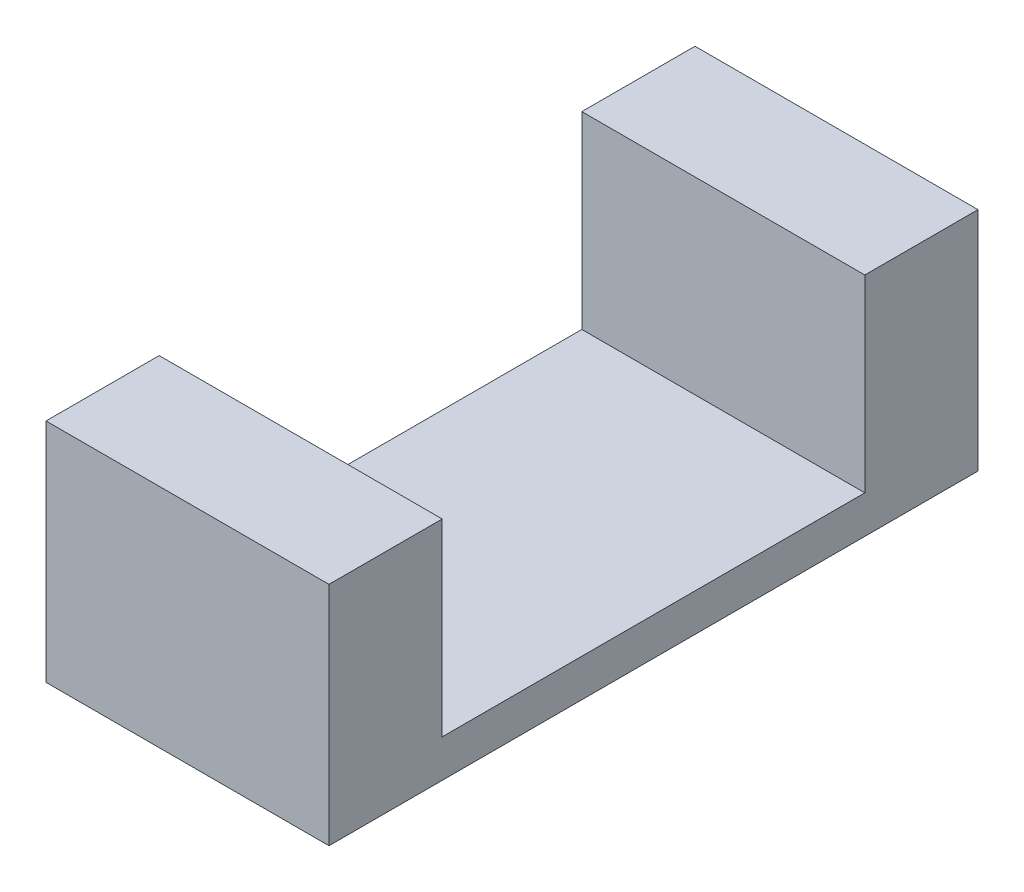
ISO-10303-21;
HEADER;
FILE_DESCRIPTION(('STEP AP214'),'2;1');
FILE_NAME('part.step','',(''),(''),'','','');
FILE_SCHEMA(('AUTOMOTIVE_DESIGN { 1 0 10303 214 1 1 1 1 }'));
ENDSEC;
DATA;
#1=APPLICATION_CONTEXT('core data for automotive mechanical design processes');
#2=APPLICATION_PROTOCOL_DEFINITION('international standard','automotive_design',2000,#1);
#3=PRODUCT_CONTEXT('',#1,'mechanical');
#4=PRODUCT('Part','Part','',(#3));
#5=PRODUCT_RELATED_PRODUCT_CATEGORY('part','',(#4));
#6=PRODUCT_DEFINITION_FORMATION('','',#4);
#7=PRODUCT_DEFINITION_CONTEXT('part definition',#1,'design');
#8=PRODUCT_DEFINITION('design','',#6,#7);
#9=PRODUCT_DEFINITION_SHAPE('','',#8);
#10=(LENGTH_UNIT() NAMED_UNIT(*) SI_UNIT(.MILLI.,.METRE.));
#11=(NAMED_UNIT(*) PLANE_ANGLE_UNIT() SI_UNIT($,.RADIAN.));
#12=(NAMED_UNIT(*) SI_UNIT($,.STERADIAN.) SOLID_ANGLE_UNIT());
#13=UNCERTAINTY_MEASURE_WITH_UNIT(LENGTH_MEASURE(1.E-05),#10,'distance_accuracy_value','');
#14=(GEOMETRIC_REPRESENTATION_CONTEXT(3) GLOBAL_UNCERTAINTY_ASSIGNED_CONTEXT((#13)) GLOBAL_UNIT_ASSIGNED_CONTEXT((#10,
#11,#12)) REPRESENTATION_CONTEXT('',''));
#15=CARTESIAN_POINT('',(0.,0.,0.));
#16=DIRECTION('',(0.,0.,1.));
#17=DIRECTION('',(1.,0.,0.));
#18=AXIS2_PLACEMENT_3D('',#15,#16,#17);
#19=CARTESIAN_POINT('',(28.28,2.77,13.36));
#20=DIRECTION('',(0.,0.,-1.));
#21=DIRECTION('',(-1.,0.,0.));
#22=AXIS2_PLACEMENT_3D('',#19,#20,#21);
#23=PLANE('',#22);
#24=DIRECTION('',(0.,1.,0.));
#25=VECTOR('',#24,1.);
#26=CARTESIAN_POINT('',(28.28,1.57,13.36));
#27=LINE('',#26,#25);
#28=CARTESIAN_POINT('',(28.28,1.77,13.36));
#29=VERTEX_POINT('',#28);
#30=CARTESIAN_POINT('',(28.28,2.77,13.36));
#31=VERTEX_POINT('',#30);
#32=EDGE_CURVE('E83',#29,#31,#27,.T.);
#33=ORIENTED_EDGE('',*,*,#32,.F.);
#34=DIRECTION('',(1.,0.,0.));
#35=VECTOR('',#34,1.);
#36=CARTESIAN_POINT('',(29.03,1.77,13.36));
#37=LINE('',#36,#35);
#38=CARTESIAN_POINT('',(29.78,1.77,13.36));
#39=VERTEX_POINT('',#38);
#40=EDGE_CURVE('E20',#29,#39,#37,.T.);
#41=ORIENTED_EDGE('',*,*,#40,.T.);
#42=DIRECTION('',(0.,1.,0.));
#43=VECTOR('',#42,1.);
#44=CARTESIAN_POINT('',(29.78,1.57,13.36));
#45=LINE('',#44,#43);
#46=CARTESIAN_POINT('',(29.78,2.77,13.36));
#47=VERTEX_POINT('',#46);
#48=EDGE_CURVE('E96',#47,#39,#45,.F.);
#49=ORIENTED_EDGE('',*,*,#48,.F.);
#50=DIRECTION('',(1.,0.,0.));
#51=VECTOR('',#50,1.);
#52=CARTESIAN_POINT('',(29.03,2.77,13.36));
#53=LINE('',#52,#51);
#54=EDGE_CURVE('E93',#31,#47,#53,.T.);
#55=ORIENTED_EDGE('',*,*,#54,.F.);
#56=EDGE_LOOP('',(#33,#41,#49,#55));
#57=FACE_BOUND('',#56,.T.);
#58=ADVANCED_FACE('F17',(#57),#23,.F.);
#59=CARTESIAN_POINT('',(29.03,1.77,14.48));
#60=DIRECTION('',(0.,-1.,0.));
#61=DIRECTION('',(0.,0.,-1.));
#62=AXIS2_PLACEMENT_3D('',#59,#60,#61);
#63=PLANE('',#62);
#64=DIRECTION('',(0.,0.,1.));
#65=VECTOR('',#64,1.);
#66=CARTESIAN_POINT('',(28.28,1.77,12.76));
#67=LINE('',#66,#65);
#68=CARTESIAN_POINT('',(28.28,1.77,15.6));
#69=VERTEX_POINT('',#68);
#70=EDGE_CURVE('E91',#69,#29,#67,.F.);
#71=ORIENTED_EDGE('',*,*,#70,.F.);
#72=DIRECTION('',(1.,0.,0.));
#73=VECTOR('',#72,1.);
#74=CARTESIAN_POINT('',(29.78,1.77,15.6));
#75=LINE('',#74,#73);
#76=CARTESIAN_POINT('',(29.78,1.77,15.6));
#77=VERTEX_POINT('',#76);
#78=EDGE_CURVE('E112',#69,#77,#75,.T.);
#79=ORIENTED_EDGE('',*,*,#78,.T.);
#80=DIRECTION('',(0.,0.,-1.));
#81=VECTOR('',#80,1.);
#82=CARTESIAN_POINT('',(29.78,1.77,16.2));
#83=LINE('',#82,#81);
#84=EDGE_CURVE('E115',#39,#77,#83,.F.);
#85=ORIENTED_EDGE('',*,*,#84,.F.);
#86=ORIENTED_EDGE('',*,*,#40,.F.);
#87=EDGE_LOOP('',(#71,#79,#85,#86));
#88=FACE_BOUND('',#87,.T.);
#89=ADVANCED_FACE('F116',(#88),#63,.F.);
#90=CARTESIAN_POINT('',(29.78,2.77,15.6));
#91=DIRECTION('',(0.,0.,1.));
#92=DIRECTION('',(1.,0.,0.));
#93=AXIS2_PLACEMENT_3D('',#90,#91,#92);
#94=PLANE('',#93);
#95=DIRECTION('',(0.,1.,0.));
#96=VECTOR('',#95,1.);
#97=CARTESIAN_POINT('',(29.78,1.57,15.6));
#98=LINE('',#97,#96);
#99=CARTESIAN_POINT('',(29.78,2.77,15.6));
#100=VERTEX_POINT('',#99);
#101=EDGE_CURVE('E118',#77,#100,#98,.T.);
#102=ORIENTED_EDGE('',*,*,#101,.F.);
#103=ORIENTED_EDGE('',*,*,#78,.F.);
#104=DIRECTION('',(0.,1.,0.));
#105=VECTOR('',#104,1.);
#106=CARTESIAN_POINT('',(28.28,1.57,15.6));
#107=LINE('',#106,#105);
#108=CARTESIAN_POINT('',(28.28,2.77,15.6));
#109=VERTEX_POINT('',#108);
#110=EDGE_CURVE('E108',#109,#69,#107,.F.);
#111=ORIENTED_EDGE('',*,*,#110,.F.);
#112=DIRECTION('',(1.,0.,0.));
#113=VECTOR('',#112,1.);
#114=CARTESIAN_POINT('',(29.03,2.77,15.6));
#115=LINE('',#114,#113);
#116=EDGE_CURVE('E100',#100,#109,#115,.F.);
#117=ORIENTED_EDGE('',*,*,#116,.F.);
#118=EDGE_LOOP('',(#102,#103,#111,#117));
#119=FACE_BOUND('',#118,.T.);
#120=ADVANCED_FACE('F134',(#119),#94,.F.);
#121=CARTESIAN_POINT('',(29.03,2.77,14.48));
#122=DIRECTION('',(0.,1.,0.));
#123=DIRECTION('',(0.,0.,1.));
#124=AXIS2_PLACEMENT_3D('',#121,#122,#123);
#125=PLANE('',#124);
#126=DIRECTION('',(1.,0.,0.));
#127=VECTOR('',#126,1.);
#128=CARTESIAN_POINT('',(28.28,2.77,16.2));
#129=LINE('',#128,#127);
#130=CARTESIAN_POINT('',(29.78,2.77,16.2));
#131=VERTEX_POINT('',#130);
#132=CARTESIAN_POINT('',(28.28,2.77,16.2));
#133=VERTEX_POINT('',#132);
#134=EDGE_CURVE('E127',#131,#133,#129,.F.);
#135=ORIENTED_EDGE('',*,*,#134,.F.);
#136=DIRECTION('',(0.,0.,-1.));
#137=VECTOR('',#136,1.);
#138=CARTESIAN_POINT('',(29.78,2.77,16.2));
#139=LINE('',#138,#137);
#140=EDGE_CURVE('E120',#100,#131,#139,.F.);
#141=ORIENTED_EDGE('',*,*,#140,.F.);
#142=ORIENTED_EDGE('',*,*,#116,.T.);
#143=DIRECTION('',(0.,0.,1.));
#144=VECTOR('',#143,1.);
#145=CARTESIAN_POINT('',(28.28,2.77,12.76));
#146=LINE('',#145,#144);
#147=EDGE_CURVE('E105',#133,#109,#146,.F.);
#148=ORIENTED_EDGE('',*,*,#147,.F.);
#149=EDGE_LOOP('',(#135,#141,#142,#148));
#150=FACE_BOUND('',#149,.T.);
#151=ADVANCED_FACE('F143',(#150),#125,.T.);
#152=CARTESIAN_POINT('',(29.03,2.77,14.48));
#153=DIRECTION('',(0.,1.,0.));
#154=DIRECTION('',(0.,0.,1.));
#155=AXIS2_PLACEMENT_3D('',#152,#153,#154);
#156=PLANE('',#155);
#157=DIRECTION('',(-1.,0.,0.));
#158=VECTOR('',#157,1.);
#159=CARTESIAN_POINT('',(29.78,2.77,12.76));
#160=LINE('',#159,#158);
#161=CARTESIAN_POINT('',(28.28,2.77,12.76));
#162=VERTEX_POINT('',#161);
#163=CARTESIAN_POINT('',(29.78,2.77,12.76));
#164=VERTEX_POINT('',#163);
#165=EDGE_CURVE('E104',#162,#164,#160,.F.);
#166=ORIENTED_EDGE('',*,*,#165,.F.);
#167=DIRECTION('',(0.,0.,1.));
#168=VECTOR('',#167,1.);
#169=CARTESIAN_POINT('',(28.28,2.77,12.76));
#170=LINE('',#169,#168);
#171=EDGE_CURVE('E89',#31,#162,#170,.F.);
#172=ORIENTED_EDGE('',*,*,#171,.F.);
#173=ORIENTED_EDGE('',*,*,#54,.T.);
#174=DIRECTION('',(0.,0.,-1.));
#175=VECTOR('',#174,1.);
#176=CARTESIAN_POINT('',(29.78,2.77,16.2));
#177=LINE('',#176,#175);
#178=EDGE_CURVE('E149',#164,#47,#177,.F.);
#179=ORIENTED_EDGE('',*,*,#178,.F.);
#180=EDGE_LOOP('',(#166,#172,#173,#179));
#181=FACE_BOUND('',#180,.T.);
#182=ADVANCED_FACE('F103',(#181),#156,.T.);
#183=CARTESIAN_POINT('',(28.28,1.57,12.76));
#184=DIRECTION('',(-1.,0.,0.));
#185=DIRECTION('',(0.,0.,1.));
#186=AXIS2_PLACEMENT_3D('',#183,#184,#185);
#187=PLANE('',#186);
#188=ORIENTED_EDGE('',*,*,#110,.T.);
#189=ORIENTED_EDGE('',*,*,#70,.T.);
#190=ORIENTED_EDGE('',*,*,#32,.T.);
#191=ORIENTED_EDGE('',*,*,#171,.T.);
#192=DIRECTION('',(0.,1.,0.));
#193=VECTOR('',#192,1.);
#194=CARTESIAN_POINT('',(28.28,1.57,12.76));
#195=LINE('',#194,#193);
#196=CARTESIAN_POINT('',(28.28,1.57,12.76));
#197=VERTEX_POINT('',#196);
#198=EDGE_CURVE('E151',#197,#162,#195,.T.);
#199=ORIENTED_EDGE('',*,*,#198,.F.);
#200=DIRECTION('',(0.,0.,1.));
#201=VECTOR('',#200,1.);
#202=CARTESIAN_POINT('',(28.28,1.57,14.48));
#203=LINE('',#202,#201);
#204=CARTESIAN_POINT('',(28.28,1.57,16.2));
#205=VERTEX_POINT('',#204);
#206=EDGE_CURVE('E157',#197,#205,#203,.T.);
#207=ORIENTED_EDGE('',*,*,#206,.T.);
#208=DIRECTION('',(0.,1.,0.));
#209=VECTOR('',#208,1.);
#210=CARTESIAN_POINT('',(28.28,1.57,16.2));
#211=LINE('',#210,#209);
#212=EDGE_CURVE('E122',#133,#205,#211,.F.);
#213=ORIENTED_EDGE('',*,*,#212,.F.);
#214=ORIENTED_EDGE('',*,*,#147,.T.);
#215=EDGE_LOOP('',(#188,#189,#190,#191,#199,#207,#213,#214));
#216=FACE_BOUND('',#215,.T.);
#217=ADVANCED_FACE('F86',(#216),#187,.T.);
#218=CARTESIAN_POINT('',(28.28,1.57,16.2));
#219=DIRECTION('',(0.,0.,1.));
#220=DIRECTION('',(1.,0.,0.));
#221=AXIS2_PLACEMENT_3D('',#218,#219,#220);
#222=PLANE('',#221);
#223=ORIENTED_EDGE('',*,*,#134,.T.);
#224=ORIENTED_EDGE('',*,*,#212,.T.);
#225=DIRECTION('',(1.,0.,0.));
#226=VECTOR('',#225,1.);
#227=CARTESIAN_POINT('',(29.03,1.57,16.2));
#228=LINE('',#227,#226);
#229=CARTESIAN_POINT('',(29.78,1.57,16.2));
#230=VERTEX_POINT('',#229);
#231=EDGE_CURVE('E148',#205,#230,#228,.T.);
#232=ORIENTED_EDGE('',*,*,#231,.T.);
#233=DIRECTION('',(0.,1.,0.));
#234=VECTOR('',#233,1.);
#235=CARTESIAN_POINT('',(29.78,1.57,16.2));
#236=LINE('',#235,#234);
#237=EDGE_CURVE('E140',#131,#230,#236,.F.);
#238=ORIENTED_EDGE('',*,*,#237,.F.);
#239=EDGE_LOOP('',(#223,#224,#232,#238));
#240=FACE_BOUND('',#239,.T.);
#241=ADVANCED_FACE('F146',(#240),#222,.T.);
#242=CARTESIAN_POINT('',(29.78,1.57,16.2));
#243=DIRECTION('',(1.,0.,0.));
#244=DIRECTION('',(0.,0.,-1.));
#245=AXIS2_PLACEMENT_3D('',#242,#243,#244);
#246=PLANE('',#245);
#247=DIRECTION('',(0.,1.,0.));
#248=VECTOR('',#247,1.);
#249=CARTESIAN_POINT('',(29.78,1.57,12.76));
#250=LINE('',#249,#248);
#251=CARTESIAN_POINT('',(29.78,1.57,12.76));
#252=VERTEX_POINT('',#251);
#253=EDGE_CURVE('E34',#164,#252,#250,.F.);
#254=ORIENTED_EDGE('',*,*,#253,.F.);
#255=ORIENTED_EDGE('',*,*,#178,.T.);
#256=ORIENTED_EDGE('',*,*,#48,.T.);
#257=ORIENTED_EDGE('',*,*,#84,.T.);
#258=ORIENTED_EDGE('',*,*,#101,.T.);
#259=ORIENTED_EDGE('',*,*,#140,.T.);
#260=ORIENTED_EDGE('',*,*,#237,.T.);
#261=DIRECTION('',(0.,0.,1.));
#262=VECTOR('',#261,1.);
#263=CARTESIAN_POINT('',(29.78,1.57,14.48));
#264=LINE('',#263,#262);
#265=EDGE_CURVE('E26',#230,#252,#264,.F.);
#266=ORIENTED_EDGE('',*,*,#265,.T.);
#267=EDGE_LOOP('',(#254,#255,#256,#257,#258,#259,#260,#266));
#268=FACE_BOUND('',#267,.T.);
#269=ADVANCED_FACE('F136',(#268),#246,.T.);
#270=CARTESIAN_POINT('',(29.78,1.57,12.76));
#271=DIRECTION('',(0.,0.,-1.));
#272=DIRECTION('',(-1.,0.,0.));
#273=AXIS2_PLACEMENT_3D('',#270,#271,#272);
#274=PLANE('',#273);
#275=ORIENTED_EDGE('',*,*,#165,.T.);
#276=ORIENTED_EDGE('',*,*,#253,.T.);
#277=DIRECTION('',(1.,0.,0.));
#278=VECTOR('',#277,1.);
#279=CARTESIAN_POINT('',(29.03,1.57,12.76));
#280=LINE('',#279,#278);
#281=EDGE_CURVE('E11',#252,#197,#280,.F.);
#282=ORIENTED_EDGE('',*,*,#281,.T.);
#283=ORIENTED_EDGE('',*,*,#198,.T.);
#284=EDGE_LOOP('',(#275,#276,#282,#283));
#285=FACE_BOUND('',#284,.T.);
#286=ADVANCED_FACE('F163',(#285),#274,.T.);
#287=CARTESIAN_POINT('',(29.03,1.57,14.48));
#288=DIRECTION('',(0.,1.,0.));
#289=DIRECTION('',(0.,0.,1.));
#290=AXIS2_PLACEMENT_3D('',#287,#288,#289);
#291=PLANE('',#290);
#292=ORIENTED_EDGE('',*,*,#265,.F.);
#293=ORIENTED_EDGE('',*,*,#231,.F.);
#294=ORIENTED_EDGE('',*,*,#206,.F.);
#295=ORIENTED_EDGE('',*,*,#281,.F.);
#296=EDGE_LOOP('',(#292,#293,#294,#295));
#297=FACE_BOUND('',#296,.T.);
#298=ADVANCED_FACE('F162',(#297),#291,.F.);
#299=CLOSED_SHELL('',(#58,#89,#120,#151,#182,#217,#241,#269,#286,#298));
#300=MANIFOLD_SOLID_BREP('B1',#299);
#301=ADVANCED_BREP_SHAPE_REPRESENTATION('',(#18,#300),#14);
#302=SHAPE_DEFINITION_REPRESENTATION(#9,#301);
ENDSEC;
END-ISO-10303-21;
